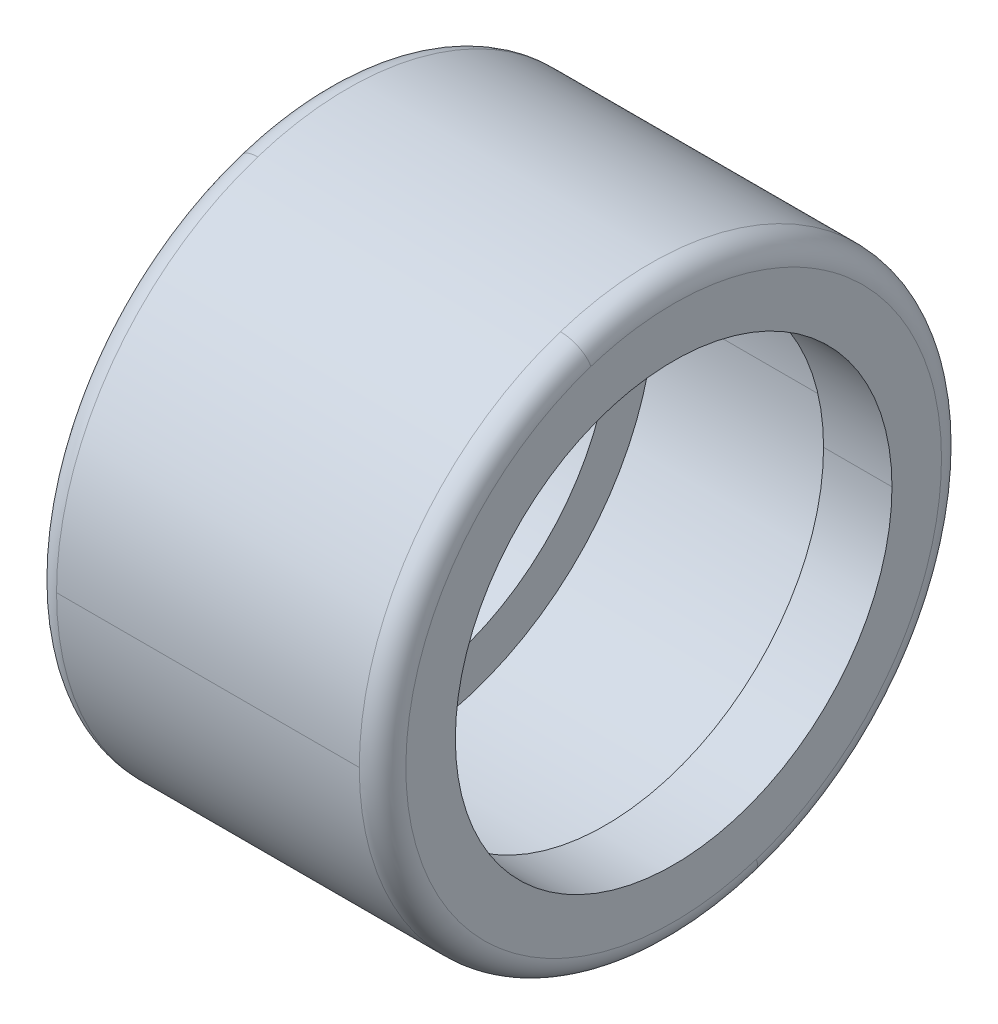
ISO-10303-21;
HEADER;
FILE_DESCRIPTION(('STEP AP214'),'2;1');
FILE_NAME('part.step','',(''),(''),'','','');
FILE_SCHEMA(('AUTOMOTIVE_DESIGN { 1 0 10303 214 1 1 1 1 }'));
ENDSEC;
DATA;
#1=APPLICATION_CONTEXT('core data for automotive mechanical design processes');
#2=APPLICATION_PROTOCOL_DEFINITION('international standard','automotive_design',2000,#1);
#3=PRODUCT_CONTEXT('',#1,'mechanical');
#4=PRODUCT('Part','Part','',(#3));
#5=PRODUCT_RELATED_PRODUCT_CATEGORY('part','',(#4));
#6=PRODUCT_DEFINITION_FORMATION('','',#4);
#7=PRODUCT_DEFINITION_CONTEXT('part definition',#1,'design');
#8=PRODUCT_DEFINITION('design','',#6,#7);
#9=PRODUCT_DEFINITION_SHAPE('','',#8);
#10=(LENGTH_UNIT() NAMED_UNIT(*) SI_UNIT(.MILLI.,.METRE.));
#11=(NAMED_UNIT(*) PLANE_ANGLE_UNIT() SI_UNIT($,.RADIAN.));
#12=(NAMED_UNIT(*) SI_UNIT($,.STERADIAN.) SOLID_ANGLE_UNIT());
#13=UNCERTAINTY_MEASURE_WITH_UNIT(LENGTH_MEASURE(1.E-05),#10,'distance_accuracy_value','');
#14=(GEOMETRIC_REPRESENTATION_CONTEXT(3) GLOBAL_UNCERTAINTY_ASSIGNED_CONTEXT((#13)) GLOBAL_UNIT_ASSIGNED_CONTEXT((#10,
#11,#12)) REPRESENTATION_CONTEXT('',''));
#15=CARTESIAN_POINT('',(0.,0.,0.));
#16=DIRECTION('',(0.,0.,1.));
#17=DIRECTION('',(1.,0.,0.));
#18=AXIS2_PLACEMENT_3D('',#15,#16,#17);
#19=CARTESIAN_POINT('',(0.80000000000006,0.,0.));
#20=DIRECTION('',(1.,0.,0.));
#21=DIRECTION('',(0.,-0.309016994374947,0.951056516295154));
#22=AXIS2_PLACEMENT_3D('',#19,#20,#21);
#23=TOROIDAL_SURFACE('',#22,9.2,0.800000000000061);
#24=CARTESIAN_POINT('',(0.80000000000006,-8.74971994991541,-2.84295634824951));
#25=DIRECTION('',(0.,0.309016994374947,-0.951056516295154));
#26=DIRECTION('',(0.,-0.951056516295154,-0.309016994374947));
#27=AXIS2_PLACEMENT_3D('',#24,#25,#26);
#28=CIRCLE('',#27,0.800000000000061);
#29=CARTESIAN_POINT('',(0.799999999999998,-9.51056516295159,-3.09016994374949));
#30=VERTEX_POINT('',#29);
#31=CARTESIAN_POINT('',(0.,-8.74971994991541,-2.84295634824951));
#32=VERTEX_POINT('',#31);
#33=EDGE_CURVE('E11',#30,#32,#28,.T.);
#34=ORIENTED_EDGE('',*,*,#33,.T.);
#35=CARTESIAN_POINT('',(0.,-8.74971994991541,-2.84295634824951));
#36=CARTESIAN_POINT('',(0.,-8.7032051754001,-2.98612443747712));
#37=CARTESIAN_POINT('',(0.,-8.65317067329749,-3.12814861219191));
#38=CARTESIAN_POINT('',(0.,-8.54619587234309,-3.40957197136774));
#39=CARTESIAN_POINT('',(0.,-8.48925557349131,-3.54897115582878));
#40=CARTESIAN_POINT('',(0.,-8.36860283746399,-3.824807373269));
#41=CARTESIAN_POINT('',(0.,-8.30489040028846,-3.96124440624817));
#42=CARTESIAN_POINT('',(0.,-8.17084781849556,-4.23082799004443));
#43=CARTESIAN_POINT('',(0.,-8.10051767387819,-4.36397454086151));
#44=CARTESIAN_POINT('',(0.,-7.95340885626128,-4.62665630268244));
#45=CARTESIAN_POINT('',(0.,-7.87663018326173,-4.75619151368629));
#46=CARTESIAN_POINT('',(0.,-7.71680934306418,-5.01133855992067));
#47=CARTESIAN_POINT('',(0.,-7.63376717586618,-5.13695039515121));
#48=CARTESIAN_POINT('',(0.,-7.46161938500327,-5.38394807303685));
#49=CARTESIAN_POINT('',(0.,-7.37251376133837,-5.50533391569195));
#50=CARTESIAN_POINT('',(0.,-7.18845372564979,-5.74358718114546));
#51=CARTESIAN_POINT('',(0.,-7.09349931362612,-5.86045460394387));
#52=CARTESIAN_POINT('',(0.,-6.89797045341445,-6.0893894853315));
#53=CARTESIAN_POINT('',(0.,-6.79739600522645,-6.20145694392072));
#54=CARTESIAN_POINT('',(0.,-6.59086936568973,-6.42052191669881));
#55=CARTESIAN_POINT('',(0.,-6.48491717434101,-6.52751943088768));
#56=CARTESIAN_POINT('',(0.,-6.2678902964987,-6.73618674844601));
#57=CARTESIAN_POINT('',(0.,-6.15681561000511,-6.83785655181546));
#58=CARTESIAN_POINT('',(0.,-5.92981133054686,-7.03562351628292));
#59=CARTESIAN_POINT('',(0.,-5.8138817375822,-7.13172067738093));
#60=CARTESIAN_POINT('',(0.,-5.57744692971877,-7.31811085082476));
#61=CARTESIAN_POINT('',(0.,-5.45694171482,-7.40840386317057));
#62=CARTESIAN_POINT('',(0.,-5.21164597070787,-7.58296821533522));
#63=CARTESIAN_POINT('',(0.,-5.0868554414945,-7.66723955515404));
#64=CARTESIAN_POINT('',(0.,-4.83328970006792,-7.82955754522561));
#65=CARTESIAN_POINT('',(0.,-4.70451448785471,-7.90760419547835));
#66=CARTESIAN_POINT('',(0.,-4.44328961119416,-8.05728478520124));
#67=CARTESIAN_POINT('',(0.,-4.31083994674682,-8.1289187246714));
#68=CARTESIAN_POINT('',(0.,-4.04258524846086,-8.26560132039455));
#69=CARTESIAN_POINT('',(0.,-3.90678021462225,-8.33064997664754));
#70=CARTESIAN_POINT('',(0.,-3.63214194377537,-8.45400529802585));
#71=CARTESIAN_POINT('',(0.,-3.49330870676711,-8.51231196315117));
#72=CARTESIAN_POINT('',(0.,-3.21294849100927,-8.6220428364108));
#73=CARTESIAN_POINT('',(0.,-3.07142151225968,-8.6734670445451));
#74=CARTESIAN_POINT('',(0.,-2.78601476390727,-8.76930911840108));
#75=CARTESIAN_POINT('',(0.,-2.64213499430445,-8.81372698412274));
#76=CARTESIAN_POINT('',(0.,-2.35236928321295,-8.89544936662436));
#77=CARTESIAN_POINT('',(0.,-2.20648334172426,-8.93275388340431));
#78=CARTESIAN_POINT('',(0.,-1.91305673887215,-9.0001596981741));
#79=CARTESIAN_POINT('',(0.,-1.76551607750873,-9.03026099616394));
#80=CARTESIAN_POINT('',(0.,-1.46913547328343,-9.08318785669006));
#81=CARTESIAN_POINT('',(0.,-1.32029553042154,-9.10601341922635));
#82=CARTESIAN_POINT('',(0.,-1.0216749316585,-9.14433382006596));
#83=CARTESIAN_POINT('',(0.,-0.871894275757341,-9.15982865836928));
#84=CARTESIAN_POINT('',(0.,-0.57175308563505,-9.18345028232027));
#85=CARTESIAN_POINT('',(0.,-0.421392551413917,-9.19157706796795));
#86=CARTESIAN_POINT('',(0.,-0.120453836348647,-9.20044300846923));
#87=CARTESIAN_POINT('',(0.,0.0301243444954906,-9.20118216332283));
#88=CARTESIAN_POINT('',(0.,0.331135596780027,-9.19527106154716));
#89=CARTESIAN_POINT('',(0.,0.481568668220426,-9.18862080491789));
#90=CARTESIAN_POINT('',(0.,0.781927295252005,-9.1679469012272));
#91=CARTESIAN_POINT('',(0.,0.931852850843185,-9.15392325416578));
#92=CARTESIAN_POINT('',(0.,1.23083526238098,-9.11853635380487));
#93=CARTESIAN_POINT('',(0.,1.37989211832759,-9.09717310050539));
#94=CARTESIAN_POINT('',(0.,1.67677803955444,-9.04715845361677));
#95=CARTESIAN_POINT('',(0.,1.82460710483467,-9.01850706002764));
#96=CARTESIAN_POINT('',(0.,2.11868131156221,-8.95398515627642));
#97=CARTESIAN_POINT('',(0.,2.26492645300951,-8.91811464611435));
#98=CARTESIAN_POINT('',(0.,2.55548049471585,-8.83924092441813));
#99=CARTESIAN_POINT('',(0.,2.69978939497491,-8.79623771288399));
#100=CARTESIAN_POINT('',(0.,2.98612330152407,-8.70320218694685));
#101=CARTESIAN_POINT('',(0.,3.12814830781419,-8.65316987254386));
#102=CARTESIAN_POINT('',(0.,3.40957227574541,-8.54619667309674));
#103=CARTESIAN_POINT('',(0.,3.54897123738652,-8.48925578805261));
#104=CARTESIAN_POINT('',(0.,3.82480729171122,-8.36860262290271));
#105=CARTESIAN_POINT('',(0.,3.96124438439482,-8.30489034279695));
#106=CARTESIAN_POINT('',(0.,4.23082801189774,-8.17084787598709));
#107=CARTESIAN_POINT('',(0.,4.36397454671708,-8.10051768928301));
#108=CARTESIAN_POINT('',(0.,4.62665629682684,-7.95340884085648));
#109=CARTESIAN_POINT('',(0.,4.75619151211727,-7.87663017913404));
#110=CARTESIAN_POINT('',(0.,5.01133856148965,-7.7168093471919));
#111=CARTESIAN_POINT('',(0.,5.1369503955716,-7.63376717697221));
#112=CARTESIAN_POINT('',(0.,5.38394807261641,-7.46161938389727));
#113=CARTESIAN_POINT('',(0.,5.50533391557928,-7.37251376104202));
#114=CARTESIAN_POINT('',(0.,5.74358718125809,-7.18845372594616));
#115=CARTESIAN_POINT('',(0.,5.86045460397403,-7.09349931370554));
#116=CARTESIAN_POINT('',(0.,6.08938948530129,-6.89797045333506));
#117=CARTESIAN_POINT('',(0.,6.20145694391261,-6.79739600520519));
#118=CARTESIAN_POINT('',(0.,6.42052191670688,-6.59086936571103));
#119=CARTESIAN_POINT('',(0.,6.52751943088983,-6.48491717434673));
#120=CARTESIAN_POINT('',(0.,6.73618674844382,-6.26789029649302));
#121=CARTESIAN_POINT('',(0.,6.83785655181486,-6.1568156100036));
#122=CARTESIAN_POINT('',(0.,7.03562351628349,-5.92981133054841));
#123=CARTESIAN_POINT('',(0.,7.13172067738107,-5.81388173758262));
#124=CARTESIAN_POINT('',(0.,7.31811085082458,-5.57744692971838));
#125=CARTESIAN_POINT('',(0.,7.40840386317051,-5.45694171481991));
#126=CARTESIAN_POINT('',(0.,7.58296821533524,-5.211645970708));
#127=CARTESIAN_POINT('',(0.,7.66723955515404,-5.08685544149455));
#128=CARTESIAN_POINT('',(0.,7.82955754522558,-4.83328970006792));
#129=CARTESIAN_POINT('',(0.,7.90760419547833,-4.70451448785472));
#130=CARTESIAN_POINT('',(0.,8.05728478520123,-4.44328961119419));
#131=CARTESIAN_POINT('',(0.,8.12891872467139,-4.31083994674684));
#132=CARTESIAN_POINT('',(0.,8.26560132039454,-4.04258524846088));
#133=CARTESIAN_POINT('',(0.,8.33064997664752,-3.90678021462227));
#134=CARTESIAN_POINT('',(0.,8.45400529802585,-3.63214194377539));
#135=CARTESIAN_POINT('',(0.,8.51231196315119,-3.49330870676713));
#136=CARTESIAN_POINT('',(0.,8.62204283641076,-3.2129484910093));
#137=CARTESIAN_POINT('',(0.,8.67346704454498,-3.07142151225973));
#138=CARTESIAN_POINT('',(0.,8.76930911840118,-2.78601476390726));
#139=CARTESIAN_POINT('',(0.,8.81372698412315,-2.64213499430436));
#140=CARTESIAN_POINT('',(0.,8.89544936662393,-2.35236928321308));
#141=CARTESIAN_POINT('',(0.,8.93275388340273,-2.20648334172471));
#142=CARTESIAN_POINT('',(0.,9.00015969817567,-1.91305673887175));
#143=CARTESIAN_POINT('',(0.,9.03026099616982,-1.76551607750716));
#144=CARTESIAN_POINT('',(0.,9.08318785668417,-1.46913547328505));
#145=CARTESIAN_POINT('',(0.,9.10601341920438,-1.32029553042753));
#146=CARTESIAN_POINT('',(0.,9.14433382008792,-1.02167493165256));
#147=CARTESIAN_POINT('',(0.,9.15982865845126,-0.871894275735111));
#148=CARTESIAN_POINT('',(0.,9.18345028223829,-0.571753085657331));
#149=CARTESIAN_POINT('',(0.,9.19157706766198,-0.421392551497003));
#150=CARTESIAN_POINT('',(0.,9.2004430087752,-0.120453836265618));
#151=CARTESIAN_POINT('',(0.,9.20118216446473,0.0301243448054401));
#152=CARTESIAN_POINT('',(0.,9.19527106040526,0.331135596470018));
#153=CARTESIAN_POINT('',(0.,9.18862080065627,0.481568667063538));
#154=CARTESIAN_POINT('',(0.,9.16794690548882,0.781927296408833));
#155=CARTESIAN_POINT('',(0.,9.15392327007035,0.931852855160607));
#156=CARTESIAN_POINT('',(0.,9.1185363379003,1.2308352580635));
#157=CARTESIAN_POINT('',(0.,9.09717304114871,1.37989210221462));
#158=CARTESIAN_POINT('',(0.,9.04715851297347,1.67677805566737));
#159=CARTESIAN_POINT('',(0.,9.01850728154982,1.824607164969));
#160=CARTESIAN_POINT('',(0.,8.95398493475425,2.11868125142783));
#161=CARTESIAN_POINT('',(0.,8.91811381938233,2.26492622858503));
#162=CARTESIAN_POINT('',(0.,8.83924175115016,2.55548071914028));
#163=CARTESIAN_POINT('',(0.,8.7962407982899,2.69979023253834));
#164=CARTESIAN_POINT('',(0.,8.74971994991543,2.84295634824947));
#165=B_SPLINE_CURVE_WITH_KNOTS('',3,(#35,#36,#37,#38,#39,#40,#41,#42,#43,#44,#45,#46,#47,#48,
#49,#50,#51,#52,#53,#54,#55,#56,#57,#58,#59,#60,#61,#62,#63,#64,#65,#66,#67,#68,#69,#70,#71,#72,
#73,#74,#75,#76,#77,#78,#79,#80,#81,#82,#83,#84,#85,#86,#87,#88,#89,#90,#91,#92,#93,#94,#95,#96,
#97,#98,#99,#100,#101,#102,#103,#104,#105,#106,#107,#108,#109,#110,#111,#112,#113,#114,#115,
#116,#117,#118,#119,#120,#121,#122,#123,#124,#125,#126,#127,#128,#129,#130,#131,#132,#133,#134,
#135,#136,#137,#138,#139,#140,#141,#142,#143,#144,#145,#146,#147,#148,#149,#150,#151,#152,#153,
#154,#155,#156,#157,#158,#159,#160,#161,#162,#163,#164),.UNSPECIFIED.,.F.,.F.,(4,2,2,2,2,2,2,2,
2,2,2,2,2,2,2,2,2,2,2,2,2,2,2,2,2,2,2,2,2,2,2,2,2,2,2,2,2,2,2,2,2,2,2,2,2,2,2,2,2,2,2,2,2,2,2,2,
2,2,2,2,2,2,2,2,4),(0.,0.451558604821586,0.903117209643169,1.35467581446475,1.80623441928634,
2.25779302410793,2.70935162892951,3.1609102337511,3.61246883857268,4.06402744339427,
4.51558604821585,4.96714465303744,5.41870325785902,5.87026186268061,6.32182046750219,
6.77337907232378,7.22493767714536,7.67649628196695,8.12805488678854,8.57961349161012,
9.03117209643171,9.48273070125329,9.93428930607488,10.3858479108965,10.837406515718,
11.2889651205396,11.7405237253612,12.1920823301828,12.6436409350044,13.095199539826,
13.5467581446476,13.9983167494691,14.4498753542907,14.9014339591123,15.3529925639339,
15.8045511687555,16.2561097735771,16.7076683783987,17.1592269832202,17.6107855880418,
18.0623441928634,18.513902797685,18.9654614025066,19.4170200073282,19.8685786121498,
20.3201372169713,20.7716958217929,21.2232544266145,21.6748130314361,22.1263716362577,
22.5779302410793,23.0294888459008,23.4810474507224,23.932606055544,24.3841646603656,
24.8357232651872,25.2872818700088,25.7388404748303,26.1903990796519,26.6419576844735,
27.0935162892951,27.5450748941167,27.9966334989383,28.4481921037599,28.8997507085814),.UNSPECIFIED.);
#166=CARTESIAN_POINT('',(0.,8.74971994991541,2.84295634824951));
#167=VERTEX_POINT('',#166);
#168=EDGE_CURVE('E26',#32,#167,#165,.T.);
#169=ORIENTED_EDGE('',*,*,#168,.T.);
#170=CARTESIAN_POINT('',(0.80000000000006,8.74971994991541,2.84295634824952));
#171=DIRECTION('',(0.,-0.309016994374948,0.951056516295154));
#172=DIRECTION('',(0.,0.951056516295154,0.309016994374948));
#173=AXIS2_PLACEMENT_3D('',#170,#171,#172);
#174=CIRCLE('',#173,0.800000000000061);
#175=CARTESIAN_POINT('',(0.799999999999998,9.51056516295159,3.09016994374949));
#176=VERTEX_POINT('',#175);
#177=EDGE_CURVE('E336',#176,#167,#174,.T.);
#178=ORIENTED_EDGE('',*,*,#177,.F.);
#179=CARTESIAN_POINT('',(0.8,0.,0.));
#180=DIRECTION('',(1.,0.,0.));
#181=DIRECTION('',(0.,0.,-1.));
#182=AXIS2_PLACEMENT_3D('',#179,#180,#181);
#183=CIRCLE('',#182,10.);
#184=CARTESIAN_POINT('',(0.8,0.,-10.));
#185=VERTEX_POINT('',#184);
#186=EDGE_CURVE('E330',#185,#176,#183,.T.);
#187=ORIENTED_EDGE('',*,*,#186,.F.);
#188=CARTESIAN_POINT('',(0.8,0.,0.));
#189=DIRECTION('',(1.,0.,0.));
#190=DIRECTION('',(0.,0.,-1.));
#191=AXIS2_PLACEMENT_3D('',#188,#189,#190);
#192=CIRCLE('',#191,10.);
#193=EDGE_CURVE('E324',#30,#185,#192,.T.);
#194=ORIENTED_EDGE('',*,*,#193,.F.);
#195=EDGE_LOOP('',(#34,#169,#178,#187,#194));
#196=FACE_BOUND('',#195,.T.);
#197=ADVANCED_FACE('F16',(#196),#23,.T.);
#198=CARTESIAN_POINT('',(50.,0.,0.));
#199=DIRECTION('',(1.,0.,0.));
#200=DIRECTION('',(0.,1.,0.));
#201=AXIS2_PLACEMENT_3D('',#198,#199,#200);
#202=CYLINDRICAL_SURFACE('',#201,10.);
#203=DIRECTION('',(1.,0.,0.));
#204=VECTOR('',#203,1.);
#205=CARTESIAN_POINT('',(0.799999999999997,0.,10.));
#206=LINE('',#205,#204);
#207=CARTESIAN_POINT('',(0.799999999999997,0.,10.));
#208=VERTEX_POINT('',#207);
#209=CARTESIAN_POINT('',(11.2,0.,10.));
#210=VERTEX_POINT('',#209);
#211=EDGE_CURVE('E319',#208,#210,#206,.T.);
#212=ORIENTED_EDGE('',*,*,#211,.F.);
#213=CARTESIAN_POINT('',(0.8,0.,0.));
#214=DIRECTION('',(1.,0.,0.));
#215=DIRECTION('',(0.,0.,-1.));
#216=AXIS2_PLACEMENT_3D('',#213,#214,#215);
#217=CIRCLE('',#216,10.);
#218=EDGE_CURVE('E313',#208,#30,#217,.T.);
#219=ORIENTED_EDGE('',*,*,#218,.T.);
#220=ORIENTED_EDGE('',*,*,#193,.T.);
#221=DIRECTION('',(1.,0.,0.));
#222=VECTOR('',#221,1.);
#223=CARTESIAN_POINT('',(0.799999999999997,0.,-10.));
#224=LINE('',#223,#222);
#225=CARTESIAN_POINT('',(11.2,0.,-10.));
#226=VERTEX_POINT('',#225);
#227=EDGE_CURVE('E308',#185,#226,#224,.T.);
#228=ORIENTED_EDGE('',*,*,#227,.T.);
#229=CARTESIAN_POINT('',(11.2,0.,0.));
#230=DIRECTION('',(1.,0.,0.));
#231=DIRECTION('',(0.,0.,-1.));
#232=AXIS2_PLACEMENT_3D('',#229,#230,#231);
#233=CIRCLE('',#232,10.);
#234=CARTESIAN_POINT('',(11.2,-9.51056516295154,-3.09016994374947));
#235=VERTEX_POINT('',#234);
#236=EDGE_CURVE('E302',#235,#226,#233,.T.);
#237=ORIENTED_EDGE('',*,*,#236,.F.);
#238=CARTESIAN_POINT('',(11.2,0.,0.));
#239=DIRECTION('',(1.,0.,0.));
#240=DIRECTION('',(0.,0.,-1.));
#241=AXIS2_PLACEMENT_3D('',#238,#239,#240);
#242=CIRCLE('',#241,10.);
#243=EDGE_CURVE('E296',#210,#235,#242,.T.);
#244=ORIENTED_EDGE('',*,*,#243,.F.);
#245=EDGE_LOOP('',(#212,#219,#220,#228,#237,#244));
#246=FACE_BOUND('',#245,.T.);
#247=ADVANCED_FACE('F368',(#246),#202,.T.);
#248=CARTESIAN_POINT('',(11.1999999999995,0.,0.));
#249=DIRECTION('',(1.,0.,0.));
#250=DIRECTION('',(0.,0.309016994374947,-0.951056516295154));
#251=AXIS2_PLACEMENT_3D('',#248,#249,#250);
#252=TOROIDAL_SURFACE('',#251,9.19999999999953,0.800000000000471);
#253=CARTESIAN_POINT('',(11.1999999999995,-8.74971994991497,-2.84295634824937));
#254=DIRECTION('',(0.,0.309016994374947,-0.951056516295154));
#255=DIRECTION('',(1.,0.,0.));
#256=AXIS2_PLACEMENT_3D('',#253,#254,#255);
#257=CIRCLE('',#256,0.800000000000471);
#258=CARTESIAN_POINT('',(12.,-8.74971994991497,-2.84295634824937));
#259=VERTEX_POINT('',#258);
#260=EDGE_CURVE('E290',#259,#235,#257,.T.);
#261=ORIENTED_EDGE('',*,*,#260,.F.);
#262=CARTESIAN_POINT('',(12.,0.,0.));
#263=DIRECTION('',(1.,0.,0.));
#264=DIRECTION('',(0.,0.,-1.));
#265=AXIS2_PLACEMENT_3D('',#262,#263,#264);
#266=CIRCLE('',#265,9.2);
#267=CARTESIAN_POINT('',(12.,8.74971994991497,2.84295634824937));
#268=VERTEX_POINT('',#267);
#269=EDGE_CURVE('E284',#268,#259,#266,.T.);
#270=ORIENTED_EDGE('',*,*,#269,.F.);
#271=CARTESIAN_POINT('',(11.1999999999995,8.74971994991497,2.84295634824937));
#272=DIRECTION('',(0.,-0.309016994374947,0.951056516295154));
#273=DIRECTION('',(1.,0.,0.));
#274=AXIS2_PLACEMENT_3D('',#271,#272,#273);
#275=CIRCLE('',#274,0.800000000000471);
#276=CARTESIAN_POINT('',(11.2,9.51056516295154,3.09016994374947));
#277=VERTEX_POINT('',#276);
#278=EDGE_CURVE('E280',#268,#277,#275,.T.);
#279=ORIENTED_EDGE('',*,*,#278,.T.);
#280=CARTESIAN_POINT('',(11.2,0.,0.));
#281=DIRECTION('',(1.,0.,0.));
#282=DIRECTION('',(0.,0.,-1.));
#283=AXIS2_PLACEMENT_3D('',#280,#281,#282);
#284=CIRCLE('',#283,10.);
#285=EDGE_CURVE('E275',#277,#210,#284,.T.);
#286=ORIENTED_EDGE('',*,*,#285,.T.);
#287=ORIENTED_EDGE('',*,*,#243,.T.);
#288=EDGE_LOOP('',(#261,#270,#279,#286,#287));
#289=FACE_BOUND('',#288,.T.);
#290=ADVANCED_FACE('F366',(#289),#252,.T.);
#291=CARTESIAN_POINT('',(50.,0.,0.));
#292=DIRECTION('',(1.,0.,0.));
#293=DIRECTION('',(0.,-1.,0.));
#294=AXIS2_PLACEMENT_3D('',#291,#292,#293);
#295=CYLINDRICAL_SURFACE('',#294,10.);
#296=ORIENTED_EDGE('',*,*,#211,.T.);
#297=ORIENTED_EDGE('',*,*,#285,.F.);
#298=CARTESIAN_POINT('',(11.2,0.,0.));
#299=DIRECTION('',(1.,0.,0.));
#300=DIRECTION('',(0.,0.,-1.));
#301=AXIS2_PLACEMENT_3D('',#298,#299,#300);
#302=CIRCLE('',#301,10.);
#303=EDGE_CURVE('E270',#226,#277,#302,.T.);
#304=ORIENTED_EDGE('',*,*,#303,.F.);
#305=ORIENTED_EDGE('',*,*,#227,.F.);
#306=ORIENTED_EDGE('',*,*,#186,.T.);
#307=CARTESIAN_POINT('',(0.8,0.,0.));
#308=DIRECTION('',(1.,0.,0.));
#309=DIRECTION('',(0.,0.,-1.));
#310=AXIS2_PLACEMENT_3D('',#307,#308,#309);
#311=CIRCLE('',#310,10.);
#312=EDGE_CURVE('E267',#176,#208,#311,.T.);
#313=ORIENTED_EDGE('',*,*,#312,.T.);
#314=EDGE_LOOP('',(#296,#297,#304,#305,#306,#313));
#315=FACE_BOUND('',#314,.T.);
#316=ADVANCED_FACE('F371',(#315),#295,.T.);
#317=CARTESIAN_POINT('',(0.80000000000006,0.,0.));
#318=DIRECTION('',(1.,0.,0.));
#319=DIRECTION('',(0.,0.309016994374947,-0.951056516295154));
#320=AXIS2_PLACEMENT_3D('',#317,#318,#319);
#321=TOROIDAL_SURFACE('',#320,9.2,0.800000000000061);
#322=ORIENTED_EDGE('',*,*,#33,.F.);
#323=ORIENTED_EDGE('',*,*,#218,.F.);
#324=ORIENTED_EDGE('',*,*,#312,.F.);
#325=ORIENTED_EDGE('',*,*,#177,.T.);
#326=CARTESIAN_POINT('',(0.,8.74971994991541,2.84295634824952));
#327=CARTESIAN_POINT('',(0.,8.7032051754001,2.98612443747712));
#328=CARTESIAN_POINT('',(0.,8.65317067329749,3.12814861219191));
#329=CARTESIAN_POINT('',(0.,8.54619587234309,3.40957197136774));
#330=CARTESIAN_POINT('',(0.,8.48925557349131,3.54897115582879));
#331=CARTESIAN_POINT('',(0.,8.36860283746399,3.824807373269));
#332=CARTESIAN_POINT('',(0.,8.30489040028846,3.96124440624818));
#333=CARTESIAN_POINT('',(0.,8.17084781849556,4.23082799004443));
#334=CARTESIAN_POINT('',(0.,8.10051767387819,4.36397454086152));
#335=CARTESIAN_POINT('',(0.,7.95340885626128,4.62665630268245));
#336=CARTESIAN_POINT('',(0.,7.87663018326173,4.75619151368629));
#337=CARTESIAN_POINT('',(0.,7.71680934306418,5.01133855992067));
#338=CARTESIAN_POINT('',(0.,7.63376717586618,5.13695039515121));
#339=CARTESIAN_POINT('',(0.,7.46161938500327,5.38394807303685));
#340=CARTESIAN_POINT('',(0.,7.37251376133836,5.50533391569195));
#341=CARTESIAN_POINT('',(0.,7.18845372564979,5.74358718114546));
#342=CARTESIAN_POINT('',(0.,7.09349931362612,5.86045460394387));
#343=CARTESIAN_POINT('',(0.,6.89797045341445,6.0893894853315));
#344=CARTESIAN_POINT('',(0.,6.79739600522645,6.20145694392072));
#345=CARTESIAN_POINT('',(0.,6.59086936568973,6.42052191669882));
#346=CARTESIAN_POINT('',(0.,6.48491717434101,6.52751943088769));
#347=CARTESIAN_POINT('',(0.,6.2678902964987,6.73618674844601));
#348=CARTESIAN_POINT('',(0.,6.15681561000511,6.83785655181546));
#349=CARTESIAN_POINT('',(0.,5.92981133054686,7.03562351628293));
#350=CARTESIAN_POINT('',(0.,5.81388173758219,7.13172067738094));
#351=CARTESIAN_POINT('',(0.,5.57744692971876,7.31811085082476));
#352=CARTESIAN_POINT('',(0.,5.45694171482,7.40840386317057));
#353=CARTESIAN_POINT('',(0.,5.21164597070787,7.58296821533522));
#354=CARTESIAN_POINT('',(0.,5.0868554414945,7.66723955515405));
#355=CARTESIAN_POINT('',(0.,4.83328970006792,7.82955754522561));
#356=CARTESIAN_POINT('',(0.,4.7045144878547,7.90760419547835));
#357=CARTESIAN_POINT('',(0.,4.44328961119415,8.05728478520125));
#358=CARTESIAN_POINT('',(0.,4.31083994674682,8.1289187246714));
#359=CARTESIAN_POINT('',(0.,4.04258524846086,8.26560132039455));
#360=CARTESIAN_POINT('',(0.,3.90678021462224,8.33064997664754));
#361=CARTESIAN_POINT('',(0.,3.63214194377537,8.45400529802585));
#362=CARTESIAN_POINT('',(0.,3.49330870676711,8.51231196315118));
#363=CARTESIAN_POINT('',(0.,3.21294849100926,8.6220428364108));
#364=CARTESIAN_POINT('',(0.,3.07142151225967,8.67346704454511));
#365=CARTESIAN_POINT('',(0.,2.78601476390726,8.76930911840108));
#366=CARTESIAN_POINT('',(0.,2.64213499430445,8.81372698412274));
#367=CARTESIAN_POINT('',(0.,2.35236928321294,8.89544936662436));
#368=CARTESIAN_POINT('',(0.,2.20648334172425,8.93275388340431));
#369=CARTESIAN_POINT('',(0.,1.91305673887214,9.0001596981741));
#370=CARTESIAN_POINT('',(0.,1.76551607750872,9.03026099616394));
#371=CARTESIAN_POINT('',(0.,1.46913547328342,9.08318785669006));
#372=CARTESIAN_POINT('',(0.,1.32029553042154,9.10601341922635));
#373=CARTESIAN_POINT('',(0.,1.02167493165849,9.14433382006596));
#374=CARTESIAN_POINT('',(0.,0.871894275757333,9.15982865836928));
#375=CARTESIAN_POINT('',(0.,0.571753085635041,9.18345028232027));
#376=CARTESIAN_POINT('',(0.,0.421392551413908,9.19157706796796));
#377=CARTESIAN_POINT('',(0.,0.120453836348639,9.20044300846923));
#378=CARTESIAN_POINT('',(0.,-0.0301243444954969,9.20118216332283));
#379=CARTESIAN_POINT('',(0.,-0.331135596780033,9.19527106154716));
#380=CARTESIAN_POINT('',(0.,-0.481568668220434,9.18862080491789));
#381=CARTESIAN_POINT('',(0.,-0.781927295252014,9.1679469012272));
#382=CARTESIAN_POINT('',(0.,-0.931852850843193,9.15392325416577));
#383=CARTESIAN_POINT('',(0.,-1.23083526238099,9.11853635380487));
#384=CARTESIAN_POINT('',(0.,-1.3798921183276,9.09717310050539));
#385=CARTESIAN_POINT('',(0.,-1.67677803955445,9.04715845361677));
#386=CARTESIAN_POINT('',(0.,-1.82460710483469,9.01850706002763));
#387=CARTESIAN_POINT('',(0.,-2.11868131156222,8.95398515627642));
#388=CARTESIAN_POINT('',(0.,-2.26492645300951,8.91811464611435));
#389=CARTESIAN_POINT('',(0.,-2.55548049471586,8.83924092441813));
#390=CARTESIAN_POINT('',(0.,-2.69978939497491,8.79623771288398));
#391=CARTESIAN_POINT('',(0.,-2.98612330152408,8.70320218694685));
#392=CARTESIAN_POINT('',(0.,-3.1281483078142,8.65316987254386));
#393=CARTESIAN_POINT('',(0.,-3.40957227574542,8.54619667309674));
#394=CARTESIAN_POINT('',(0.,-3.54897123738653,8.4892557880526));
#395=CARTESIAN_POINT('',(0.,-3.82480729171123,8.36860262290271));
#396=CARTESIAN_POINT('',(0.,-3.96124438439482,8.30489034279695));
#397=CARTESIAN_POINT('',(0.,-4.23082801189775,8.1708478759871));
#398=CARTESIAN_POINT('',(0.,-4.36397454671709,8.10051768928301));
#399=CARTESIAN_POINT('',(0.,-4.62665629682685,7.95340884085648));
#400=CARTESIAN_POINT('',(0.,-4.75619151211728,7.87663017913404));
#401=CARTESIAN_POINT('',(0.,-5.01133856148966,7.7168093471919));
#402=CARTESIAN_POINT('',(0.,-5.13695039557161,7.63376717697221));
#403=CARTESIAN_POINT('',(0.,-5.38394807261642,7.46161938389726));
#404=CARTESIAN_POINT('',(0.,-5.50533391557929,7.37251376104202));
#405=CARTESIAN_POINT('',(0.,-5.7435871812581,7.18845372594615));
#406=CARTESIAN_POINT('',(0.,-5.86045460397404,7.09349931370554));
#407=CARTESIAN_POINT('',(0.,-6.0893894853013,6.89797045333505));
#408=CARTESIAN_POINT('',(0.,-6.20145694391262,6.79739600520519));
#409=CARTESIAN_POINT('',(0.,-6.42052191670689,6.59086936571102));
#410=CARTESIAN_POINT('',(0.,-6.52751943088984,6.48491717434672));
#411=CARTESIAN_POINT('',(0.,-6.73618674844383,6.26789029649301));
#412=CARTESIAN_POINT('',(0.,-6.83785655181487,6.15681561000359));
#413=CARTESIAN_POINT('',(0.,-7.0356235162835,5.92981133054839));
#414=CARTESIAN_POINT('',(0.,-7.13172067738108,5.81388173758261));
#415=CARTESIAN_POINT('',(0.,-7.31811085082459,5.57744692971837));
#416=CARTESIAN_POINT('',(0.,-7.40840386317052,5.4569417148199));
#417=CARTESIAN_POINT('',(0.,-7.58296821533525,5.21164597070799));
#418=CARTESIAN_POINT('',(0.,-7.66723955515405,5.08685544149454));
#419=CARTESIAN_POINT('',(0.,-7.82955754522559,4.8332897000679));
#420=CARTESIAN_POINT('',(0.,-7.90760419547834,4.70451448785471));
#421=CARTESIAN_POINT('',(0.,-8.05728478520124,4.44328961119418));
#422=CARTESIAN_POINT('',(0.,-8.1289187246714,4.31083994674683));
#423=CARTESIAN_POINT('',(0.,-8.26560132039454,4.04258524846087));
#424=CARTESIAN_POINT('',(0.,-8.33064997664753,3.90678021462226));
#425=CARTESIAN_POINT('',(0.,-8.45400529802586,3.63214194377538));
#426=CARTESIAN_POINT('',(0.,-8.5123119631512,3.49330870676711));
#427=CARTESIAN_POINT('',(0.,-8.62204283641077,3.21294849100928));
#428=CARTESIAN_POINT('',(0.,-8.67346704454499,3.07142151225972));
#429=CARTESIAN_POINT('',(0.,-8.76930911840118,2.78601476390725));
#430=CARTESIAN_POINT('',(0.,-8.81372698412316,2.64213499430435));
#431=CARTESIAN_POINT('',(0.,-8.89544936662393,2.35236928321307));
#432=CARTESIAN_POINT('',(0.,-8.93275388340273,2.2064833417247));
#433=CARTESIAN_POINT('',(0.,-9.00015969817568,1.91305673887173));
#434=CARTESIAN_POINT('',(0.,-9.03026099616982,1.76551607750714));
#435=CARTESIAN_POINT('',(0.,-9.08318785668417,1.46913547328504));
#436=CARTESIAN_POINT('',(0.,-9.10601341920438,1.32029553042752));
#437=CARTESIAN_POINT('',(0.,-9.14433382008793,1.02167493165255));
#438=CARTESIAN_POINT('',(0.,-9.15982865845126,0.871894275735096));
#439=CARTESIAN_POINT('',(0.,-9.18345028223829,0.571753085657314));
#440=CARTESIAN_POINT('',(0.,-9.19157706766198,0.421392551496986));
#441=CARTESIAN_POINT('',(0.,-9.2004430087752,0.1204538362656));
#442=CARTESIAN_POINT('',(0.,-9.20118216446473,-0.0301243448054577));
#443=CARTESIAN_POINT('',(0.,-9.19527106040526,-0.331135596470036));
#444=CARTESIAN_POINT('',(0.,-9.18862080065627,-0.481568667063556));
#445=CARTESIAN_POINT('',(0.,-9.16794690548881,-0.781927296408851));
#446=CARTESIAN_POINT('',(0.,-9.15392327007035,-0.931852855160625));
#447=CARTESIAN_POINT('',(0.,-9.1185363379003,-1.23083525806351));
#448=CARTESIAN_POINT('',(0.,-9.0971730411487,-1.37989210221463));
#449=CARTESIAN_POINT('',(0.,-9.04715851297346,-1.67677805566738));
#450=CARTESIAN_POINT('',(0.,-9.01850728154981,-1.82460716496901));
#451=CARTESIAN_POINT('',(0.,-8.95398493475425,-2.11868125142784));
#452=CARTESIAN_POINT('',(0.,-8.91811381938233,-2.26492622858504));
#453=CARTESIAN_POINT('',(0.,-8.83924175115015,-2.55548071914029));
#454=CARTESIAN_POINT('',(0.,-8.79624079828989,-2.69979023253835));
#455=CARTESIAN_POINT('',(0.,-8.74971994991542,-2.84295634824948));
#456=B_SPLINE_CURVE_WITH_KNOTS('',3,(#326,#327,#328,#329,#330,#331,#332,#333,#334,#335,#336,
#337,#338,#339,#340,#341,#342,#343,#344,#345,#346,#347,#348,#349,#350,#351,#352,#353,#354,#355,
#356,#357,#358,#359,#360,#361,#362,#363,#364,#365,#366,#367,#368,#369,#370,#371,#372,#373,#374,
#375,#376,#377,#378,#379,#380,#381,#382,#383,#384,#385,#386,#387,#388,#389,#390,#391,#392,#393,
#394,#395,#396,#397,#398,#399,#400,#401,#402,#403,#404,#405,#406,#407,#408,#409,#410,#411,#412,
#413,#414,#415,#416,#417,#418,#419,#420,#421,#422,#423,#424,#425,#426,#427,#428,#429,#430,#431,
#432,#433,#434,#435,#436,#437,#438,#439,#440,#441,#442,#443,#444,#445,#446,#447,#448,#449,#450,
#451,#452,#453,#454,#455),.UNSPECIFIED.,.F.,.F.,(4,2,2,2,2,2,2,2,2,2,2,2,2,2,2,2,2,2,2,2,2,2,2,
2,2,2,2,2,2,2,2,2,2,2,2,2,2,2,2,2,2,2,2,2,2,2,2,2,2,2,2,2,2,2,2,2,2,2,2,2,2,2,2,2,4),(0.,
0.451558604821586,0.90311720964317,1.35467581446476,1.80623441928634,2.25779302410793,
2.70935162892951,3.1609102337511,3.61246883857268,4.06402744339427,4.51558604821585,
4.96714465303744,5.41870325785903,5.87026186268061,6.3218204675022,6.77337907232378,
7.22493767714537,7.67649628196695,8.12805488678854,8.57961349161013,9.03117209643171,
9.4827307012533,9.93428930607488,10.3858479108965,10.8374065157181,11.2889651205396,
11.7405237253612,12.1920823301828,12.6436409350044,13.095199539826,13.5467581446476,
13.9983167494692,14.4498753542907,14.9014339591123,15.3529925639339,15.8045511687555,
16.2561097735771,16.7076683783987,17.1592269832203,17.6107855880418,18.0623441928634,
18.513902797685,18.9654614025066,19.4170200073282,19.8685786121498,20.3201372169714,
20.7716958217929,21.2232544266145,21.6748130314361,22.1263716362577,22.5779302410793,
23.0294888459009,23.4810474507224,23.932606055544,24.3841646603656,24.8357232651872,
25.2872818700088,25.7388404748304,26.190399079652,26.6419576844735,27.0935162892951,
27.5450748941167,27.9966334989383,28.4481921037599,28.8997507085815),.UNSPECIFIED.);
#457=EDGE_CURVE('E253',#167,#32,#456,.T.);
#458=ORIENTED_EDGE('',*,*,#457,.T.);
#459=EDGE_LOOP('',(#322,#323,#324,#325,#458));
#460=FACE_BOUND('',#459,.T.);
#461=ADVANCED_FACE('F230',(#460),#321,.T.);
#462=CARTESIAN_POINT('',(0.,9.2,0.));
#463=DIRECTION('',(-1.,0.,0.));
#464=DIRECTION('',(0.,0.,1.));
#465=AXIS2_PLACEMENT_3D('',#462,#463,#464);
#466=PLANE('',#465);
#467=CARTESIAN_POINT('',(0.,0.,0.));
#468=DIRECTION('',(1.,0.,0.));
#469=DIRECTION('',(0.,0.,-1.));
#470=AXIS2_PLACEMENT_3D('',#467,#468,#469);
#471=CIRCLE('',#470,7.5);
#472=CARTESIAN_POINT('',(0.,0.,-7.5));
#473=VERTEX_POINT('',#472);
#474=CARTESIAN_POINT('',(0.,0.,7.5));
#475=VERTEX_POINT('',#474);
#476=EDGE_CURVE('E248',#473,#475,#471,.T.);
#477=ORIENTED_EDGE('',*,*,#476,.T.);
#478=CARTESIAN_POINT('',(0.,0.,0.));
#479=DIRECTION('',(1.,0.,0.));
#480=DIRECTION('',(0.,0.,-1.));
#481=AXIS2_PLACEMENT_3D('',#478,#479,#480);
#482=CIRCLE('',#481,7.5);
#483=EDGE_CURVE('E211',#475,#473,#482,.T.);
#484=ORIENTED_EDGE('',*,*,#483,.T.);
#485=EDGE_LOOP('',(#477,#484));
#486=FACE_BOUND('',#485,.T.);
#487=ORIENTED_EDGE('',*,*,#168,.F.);
#488=ORIENTED_EDGE('',*,*,#457,.F.);
#489=EDGE_LOOP('',(#487,#488));
#490=FACE_BOUND('',#489,.T.);
#491=ADVANCED_FACE('F219',(#486,#490),#466,.T.);
#492=CARTESIAN_POINT('',(50.,0.,0.));
#493=DIRECTION('',(1.,0.,0.));
#494=DIRECTION('',(0.,1.,0.));
#495=AXIS2_PLACEMENT_3D('',#492,#493,#494);
#496=CYLINDRICAL_SURFACE('',#495,7.5);
#497=DIRECTION('',(1.,0.,0.));
#498=VECTOR('',#497,1.);
#499=CARTESIAN_POINT('',(0.,0.,7.5));
#500=LINE('',#499,#498);
#501=CARTESIAN_POINT('',(2.35,0.,7.5));
#502=VERTEX_POINT('',#501);
#503=EDGE_CURVE('E207',#475,#502,#500,.T.);
#504=ORIENTED_EDGE('',*,*,#503,.T.);
#505=CARTESIAN_POINT('',(2.35,0.,0.));
#506=DIRECTION('',(1.,0.,0.));
#507=DIRECTION('',(0.,0.,-1.));
#508=AXIS2_PLACEMENT_3D('',#505,#506,#507);
#509=CIRCLE('',#508,7.5);
#510=CARTESIAN_POINT('',(2.35,0.,-7.5));
#511=VERTEX_POINT('',#510);
#512=EDGE_CURVE('E202',#502,#511,#509,.T.);
#513=ORIENTED_EDGE('',*,*,#512,.T.);
#514=DIRECTION('',(1.,0.,0.));
#515=VECTOR('',#514,1.);
#516=CARTESIAN_POINT('',(0.,0.,-7.5));
#517=LINE('',#516,#515);
#518=EDGE_CURVE('E196',#473,#511,#517,.T.);
#519=ORIENTED_EDGE('',*,*,#518,.F.);
#520=ORIENTED_EDGE('',*,*,#483,.F.);
#521=EDGE_LOOP('',(#504,#513,#519,#520));
#522=FACE_BOUND('',#521,.T.);
#523=ADVANCED_FACE('F229',(#522),#496,.F.);
#524=CARTESIAN_POINT('',(50.,0.,0.));
#525=DIRECTION('',(1.,0.,0.));
#526=DIRECTION('',(0.,-1.,0.));
#527=AXIS2_PLACEMENT_3D('',#524,#525,#526);
#528=CYLINDRICAL_SURFACE('',#527,7.5);
#529=ORIENTED_EDGE('',*,*,#503,.F.);
#530=ORIENTED_EDGE('',*,*,#476,.F.);
#531=ORIENTED_EDGE('',*,*,#518,.T.);
#532=CARTESIAN_POINT('',(2.35,0.,0.));
#533=DIRECTION('',(1.,0.,0.));
#534=DIRECTION('',(0.,0.,-1.));
#535=AXIS2_PLACEMENT_3D('',#532,#533,#534);
#536=CIRCLE('',#535,7.5);
#537=EDGE_CURVE('E190',#511,#502,#536,.T.);
#538=ORIENTED_EDGE('',*,*,#537,.T.);
#539=EDGE_LOOP('',(#529,#530,#531,#538));
#540=FACE_BOUND('',#539,.T.);
#541=ADVANCED_FACE('F414',(#540),#528,.F.);
#542=CARTESIAN_POINT('',(2.35,7.5,0.));
#543=DIRECTION('',(1.,0.,0.));
#544=DIRECTION('',(0.,0.,-1.));
#545=AXIS2_PLACEMENT_3D('',#542,#543,#544);
#546=PLANE('',#545);
#547=CARTESIAN_POINT('',(2.35,0.,0.));
#548=DIRECTION('',(1.,0.,0.));
#549=DIRECTION('',(0.,0.,-1.));
#550=AXIS2_PLACEMENT_3D('',#547,#548,#549);
#551=CIRCLE('',#550,9.);
#552=CARTESIAN_POINT('',(2.35,0.,-9.));
#553=VERTEX_POINT('',#552);
#554=CARTESIAN_POINT('',(2.35,0.,9.));
#555=VERTEX_POINT('',#554);
#556=EDGE_CURVE('E185',#553,#555,#551,.T.);
#557=ORIENTED_EDGE('',*,*,#556,.T.);
#558=CARTESIAN_POINT('',(2.35,0.,0.));
#559=DIRECTION('',(1.,0.,0.));
#560=DIRECTION('',(0.,0.,-1.));
#561=AXIS2_PLACEMENT_3D('',#558,#559,#560);
#562=CIRCLE('',#561,9.);
#563=EDGE_CURVE('E180',#555,#553,#562,.T.);
#564=ORIENTED_EDGE('',*,*,#563,.T.);
#565=EDGE_LOOP('',(#557,#564));
#566=FACE_BOUND('',#565,.T.);
#567=ORIENTED_EDGE('',*,*,#512,.F.);
#568=ORIENTED_EDGE('',*,*,#537,.F.);
#569=EDGE_LOOP('',(#567,#568));
#570=FACE_BOUND('',#569,.T.);
#571=ADVANCED_FACE('F422',(#566,#570),#546,.T.);
#572=CARTESIAN_POINT('',(50.,0.,0.));
#573=DIRECTION('',(1.,0.,0.));
#574=DIRECTION('',(0.,1.,0.));
#575=AXIS2_PLACEMENT_3D('',#572,#573,#574);
#576=CYLINDRICAL_SURFACE('',#575,9.);
#577=DIRECTION('',(1.,0.,0.));
#578=VECTOR('',#577,1.);
#579=CARTESIAN_POINT('',(2.35,0.,9.));
#580=LINE('',#579,#578);
#581=CARTESIAN_POINT('',(9.65,0.,9.));
#582=VERTEX_POINT('',#581);
#583=EDGE_CURVE('E176',#555,#582,#580,.T.);
#584=ORIENTED_EDGE('',*,*,#583,.T.);
#585=CARTESIAN_POINT('',(9.65,0.,0.));
#586=DIRECTION('',(1.,0.,0.));
#587=DIRECTION('',(0.,0.,-1.));
#588=AXIS2_PLACEMENT_3D('',#585,#586,#587);
#589=CIRCLE('',#588,9.);
#590=CARTESIAN_POINT('',(9.65,0.,-9.));
#591=VERTEX_POINT('',#590);
#592=EDGE_CURVE('E171',#582,#591,#589,.T.);
#593=ORIENTED_EDGE('',*,*,#592,.T.);
#594=DIRECTION('',(1.,0.,0.));
#595=VECTOR('',#594,1.);
#596=CARTESIAN_POINT('',(2.35,0.,-9.));
#597=LINE('',#596,#595);
#598=EDGE_CURVE('E165',#553,#591,#597,.T.);
#599=ORIENTED_EDGE('',*,*,#598,.F.);
#600=ORIENTED_EDGE('',*,*,#563,.F.);
#601=EDGE_LOOP('',(#584,#593,#599,#600));
#602=FACE_BOUND('',#601,.T.);
#603=ADVANCED_FACE('F429',(#602),#576,.F.);
#604=CARTESIAN_POINT('',(50.,0.,0.));
#605=DIRECTION('',(1.,0.,0.));
#606=DIRECTION('',(0.,-1.,0.));
#607=AXIS2_PLACEMENT_3D('',#604,#605,#606);
#608=CYLINDRICAL_SURFACE('',#607,9.);
#609=ORIENTED_EDGE('',*,*,#583,.F.);
#610=ORIENTED_EDGE('',*,*,#556,.F.);
#611=ORIENTED_EDGE('',*,*,#598,.T.);
#612=CARTESIAN_POINT('',(9.65,0.,0.));
#613=DIRECTION('',(1.,0.,0.));
#614=DIRECTION('',(0.,0.,-1.));
#615=AXIS2_PLACEMENT_3D('',#612,#613,#614);
#616=CIRCLE('',#615,9.);
#617=EDGE_CURVE('E159',#591,#582,#616,.T.);
#618=ORIENTED_EDGE('',*,*,#617,.T.);
#619=EDGE_LOOP('',(#609,#610,#611,#618));
#620=FACE_BOUND('',#619,.T.);
#621=ADVANCED_FACE('F437',(#620),#608,.F.);
#622=CARTESIAN_POINT('',(9.65,9.,0.));
#623=DIRECTION('',(-1.,0.,0.));
#624=DIRECTION('',(0.,0.,1.));
#625=AXIS2_PLACEMENT_3D('',#622,#623,#624);
#626=PLANE('',#625);
#627=CARTESIAN_POINT('',(9.65,0.,0.));
#628=DIRECTION('',(1.,0.,0.));
#629=DIRECTION('',(0.,0.,-1.));
#630=AXIS2_PLACEMENT_3D('',#627,#628,#629);
#631=CIRCLE('',#630,7.5);
#632=CARTESIAN_POINT('',(9.65,0.,-7.5));
#633=VERTEX_POINT('',#632);
#634=CARTESIAN_POINT('',(9.65,0.,7.5));
#635=VERTEX_POINT('',#634);
#636=EDGE_CURVE('E137',#633,#635,#631,.T.);
#637=ORIENTED_EDGE('',*,*,#636,.T.);
#638=CARTESIAN_POINT('',(9.65,0.,0.));
#639=DIRECTION('',(1.,0.,0.));
#640=DIRECTION('',(0.,0.,-1.));
#641=AXIS2_PLACEMENT_3D('',#638,#639,#640);
#642=CIRCLE('',#641,7.5);
#643=EDGE_CURVE('E151',#635,#633,#642,.T.);
#644=ORIENTED_EDGE('',*,*,#643,.T.);
#645=EDGE_LOOP('',(#637,#644));
#646=FACE_BOUND('',#645,.T.);
#647=ORIENTED_EDGE('',*,*,#592,.F.);
#648=ORIENTED_EDGE('',*,*,#617,.F.);
#649=EDGE_LOOP('',(#647,#648));
#650=FACE_BOUND('',#649,.T.);
#651=ADVANCED_FACE('F445',(#646,#650),#626,.T.);
#652=CARTESIAN_POINT('',(50.,0.,0.));
#653=DIRECTION('',(1.,0.,0.));
#654=DIRECTION('',(0.,1.,0.));
#655=AXIS2_PLACEMENT_3D('',#652,#653,#654);
#656=CYLINDRICAL_SURFACE('',#655,7.5);
#657=DIRECTION('',(1.,0.,0.));
#658=VECTOR('',#657,1.);
#659=CARTESIAN_POINT('',(9.65,0.,7.5));
#660=LINE('',#659,#658);
#661=CARTESIAN_POINT('',(12.,0.,7.5));
#662=VERTEX_POINT('',#661);
#663=EDGE_CURVE('E124',#635,#662,#660,.T.);
#664=ORIENTED_EDGE('',*,*,#663,.T.);
#665=CARTESIAN_POINT('',(12.,0.,0.));
#666=DIRECTION('',(1.,0.,0.));
#667=DIRECTION('',(0.,0.,-1.));
#668=AXIS2_PLACEMENT_3D('',#665,#666,#667);
#669=CIRCLE('',#668,7.5);
#670=CARTESIAN_POINT('',(12.,0.,-7.5));
#671=VERTEX_POINT('',#670);
#672=EDGE_CURVE('E117',#662,#671,#669,.T.);
#673=ORIENTED_EDGE('',*,*,#672,.T.);
#674=DIRECTION('',(1.,0.,0.));
#675=VECTOR('',#674,1.);
#676=CARTESIAN_POINT('',(9.65,0.,-7.5));
#677=LINE('',#676,#675);
#678=EDGE_CURVE('E122',#633,#671,#677,.T.);
#679=ORIENTED_EDGE('',*,*,#678,.F.);
#680=ORIENTED_EDGE('',*,*,#643,.F.);
#681=EDGE_LOOP('',(#664,#673,#679,#680));
#682=FACE_BOUND('',#681,.T.);
#683=ADVANCED_FACE('F119',(#682),#656,.F.);
#684=CARTESIAN_POINT('',(50.,0.,0.));
#685=DIRECTION('',(1.,0.,0.));
#686=DIRECTION('',(0.,-1.,0.));
#687=AXIS2_PLACEMENT_3D('',#684,#685,#686);
#688=CYLINDRICAL_SURFACE('',#687,7.5);
#689=ORIENTED_EDGE('',*,*,#663,.F.);
#690=ORIENTED_EDGE('',*,*,#636,.F.);
#691=ORIENTED_EDGE('',*,*,#678,.T.);
#692=CARTESIAN_POINT('',(12.,0.,0.));
#693=DIRECTION('',(1.,0.,0.));
#694=DIRECTION('',(0.,0.,-1.));
#695=AXIS2_PLACEMENT_3D('',#692,#693,#694);
#696=CIRCLE('',#695,7.5);
#697=EDGE_CURVE('E129',#671,#662,#696,.T.);
#698=ORIENTED_EDGE('',*,*,#697,.T.);
#699=EDGE_LOOP('',(#689,#690,#691,#698));
#700=FACE_BOUND('',#699,.T.);
#701=ADVANCED_FACE('F136',(#700),#688,.F.);
#702=CARTESIAN_POINT('',(12.,7.5,0.));
#703=DIRECTION('',(1.,0.,0.));
#704=DIRECTION('',(0.,0.,-1.));
#705=AXIS2_PLACEMENT_3D('',#702,#703,#704);
#706=PLANE('',#705);
#707=ORIENTED_EDGE('',*,*,#269,.T.);
#708=CARTESIAN_POINT('',(12.,-8.74971994991541,-2.84295634824951));
#709=CARTESIAN_POINT('',(12.,-7.85574171850998,-5.59053959163784));
#710=CARTESIAN_POINT('',(12.,-5.88760930783075,-7.99491529928625));
#711=CARTESIAN_POINT('',(12.,-3.00569702361898,-9.45958369245147));
#712=CARTESIAN_POINT('',(12.,3.19282932865889,-9.82651826182372));
#713=CARTESIAN_POINT('',(12.,7.99186375929927,-5.88625958356274));
#714=CARTESIAN_POINT('',(12.,9.46246929252318,-3.00737242330801));
#715=CARTESIAN_POINT('',(12.,9.64146527801671,0.094647590597889));
#716=CARTESIAN_POINT('',(12.,8.74971994991541,2.84295634824951));
#717=B_SPLINE_CURVE_WITH_KNOTS('',5,(#708,#709,#710,#711,#712,#713,#714,#715,#716),
.UNSPECIFIED.,.F.,.F.,(6,3,6),(0.,1.5707963267949,3.14159265358979),.UNSPECIFIED.);
#718=EDGE_CURVE('E133',#259,#268,#717,.T.);
#719=ORIENTED_EDGE('',*,*,#718,.T.);
#720=EDGE_LOOP('',(#707,#719));
#721=FACE_BOUND('',#720,.T.);
#722=ORIENTED_EDGE('',*,*,#672,.F.);
#723=ORIENTED_EDGE('',*,*,#697,.F.);
#724=EDGE_LOOP('',(#722,#723));
#725=FACE_BOUND('',#724,.T.);
#726=ADVANCED_FACE('F130',(#721,#725),#706,.T.);
#727=CARTESIAN_POINT('',(11.1999999999995,0.,0.));
#728=DIRECTION('',(1.,0.,0.));
#729=DIRECTION('',(0.,-0.309016994374947,0.951056516295154));
#730=AXIS2_PLACEMENT_3D('',#727,#728,#729);
#731=TOROIDAL_SURFACE('',#730,9.19999999999953,0.800000000000471);
#732=ORIENTED_EDGE('',*,*,#260,.T.);
#733=ORIENTED_EDGE('',*,*,#236,.T.);
#734=ORIENTED_EDGE('',*,*,#303,.T.);
#735=ORIENTED_EDGE('',*,*,#278,.F.);
#736=ORIENTED_EDGE('',*,*,#718,.F.);
#737=EDGE_LOOP('',(#732,#733,#734,#735,#736));
#738=FACE_BOUND('',#737,.T.);
#739=ADVANCED_FACE('F362',(#738),#731,.T.);
#740=CLOSED_SHELL('',(#197,#247,#290,#316,#461,#491,#523,#541,#571,#603,#621,#651,#683,#701,
#726,#739));
#741=MANIFOLD_SOLID_BREP('B1',#740);
#742=ADVANCED_BREP_SHAPE_REPRESENTATION('',(#18,#741),#14);
#743=SHAPE_DEFINITION_REPRESENTATION(#9,#742);
ENDSEC;
END-ISO-10303-21;
